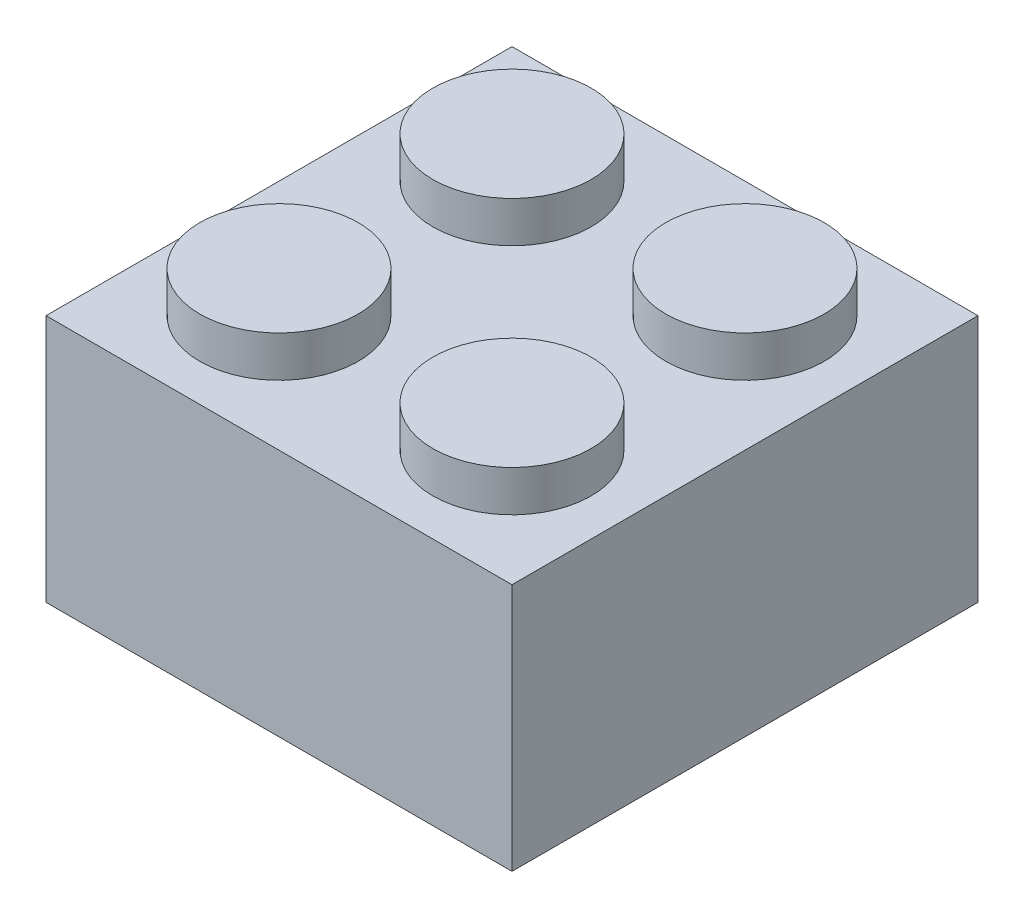
ISO-10303-21;
HEADER;
FILE_DESCRIPTION(('STEP AP214'),'2;1');
FILE_NAME('part.step','',(''),(''),'','','');
FILE_SCHEMA(('AUTOMOTIVE_DESIGN { 1 0 10303 214 1 1 1 1 }'));
ENDSEC;
DATA;
#1=APPLICATION_CONTEXT('core data for automotive mechanical design processes');
#2=APPLICATION_PROTOCOL_DEFINITION('international standard','automotive_design',2000,#1);
#3=PRODUCT_CONTEXT('',#1,'mechanical');
#4=PRODUCT('Part','Part','',(#3));
#5=PRODUCT_RELATED_PRODUCT_CATEGORY('part','',(#4));
#6=PRODUCT_DEFINITION_FORMATION('','',#4);
#7=PRODUCT_DEFINITION_CONTEXT('part definition',#1,'design');
#8=PRODUCT_DEFINITION('design','',#6,#7);
#9=PRODUCT_DEFINITION_SHAPE('','',#8);
#10=(LENGTH_UNIT() NAMED_UNIT(*) SI_UNIT(.MILLI.,.METRE.));
#11=(NAMED_UNIT(*) PLANE_ANGLE_UNIT() SI_UNIT($,.RADIAN.));
#12=(NAMED_UNIT(*) SI_UNIT($,.STERADIAN.) SOLID_ANGLE_UNIT());
#13=UNCERTAINTY_MEASURE_WITH_UNIT(LENGTH_MEASURE(1.E-05),#10,'distance_accuracy_value','');
#14=(GEOMETRIC_REPRESENTATION_CONTEXT(3) GLOBAL_UNCERTAINTY_ASSIGNED_CONTEXT((#13)) GLOBAL_UNIT_ASSIGNED_CONTEXT((#10,
#11,#12)) REPRESENTATION_CONTEXT('',''));
#15=CARTESIAN_POINT('',(0.,0.,0.));
#16=DIRECTION('',(0.,0.,1.));
#17=DIRECTION('',(1.,0.,0.));
#18=AXIS2_PLACEMENT_3D('',#15,#16,#17);
#19=CARTESIAN_POINT('',(7.93750000000001,4.2291,7.93749999999999));
#20=DIRECTION('',(0.,1.,0.));
#21=DIRECTION('',(0.,0.,1.));
#22=AXIS2_PLACEMENT_3D('',#19,#20,#21);
#23=PLANE('',#22);
#24=CARTESIAN_POINT('',(-3.96875,4.2291,3.96875));
#25=DIRECTION('',(0.,1.,0.));
#26=DIRECTION('',(0.,0.,1.));
#27=AXIS2_PLACEMENT_3D('',#24,#25,#26);
#28=CIRCLE('',#27,2.69875);
#29=CARTESIAN_POINT('',(-3.96875,4.2291,6.6675));
#30=VERTEX_POINT('',#29);
#31=EDGE_CURVE('E284',#30,#30,#28,.T.);
#32=ORIENTED_EDGE('',*,*,#31,.F.);
#33=EDGE_LOOP('',(#32));
#34=FACE_BOUND('',#33,.T.);
#35=CARTESIAN_POINT('',(3.96875,4.2291,3.96875));
#36=DIRECTION('',(0.,1.,0.));
#37=DIRECTION('',(0.,0.,1.));
#38=AXIS2_PLACEMENT_3D('',#35,#36,#37);
#39=CIRCLE('',#38,2.69875);
#40=CARTESIAN_POINT('',(3.96875,4.2291,6.6675));
#41=VERTEX_POINT('',#40);
#42=EDGE_CURVE('E299',#41,#41,#39,.T.);
#43=ORIENTED_EDGE('',*,*,#42,.F.);
#44=EDGE_LOOP('',(#43));
#45=FACE_BOUND('',#44,.T.);
#46=DIRECTION('',(0.,0.,-1.));
#47=VECTOR('',#46,1.);
#48=CARTESIAN_POINT('',(7.9375,4.2291,-7.9375));
#49=LINE('',#48,#47);
#50=CARTESIAN_POINT('',(7.93750000000001,4.2291,7.93749999999999));
#51=VERTEX_POINT('',#50);
#52=CARTESIAN_POINT('',(7.9375,4.2291,-7.9375));
#53=VERTEX_POINT('',#52);
#54=EDGE_CURVE('E173',#51,#53,#49,.T.);
#55=ORIENTED_EDGE('',*,*,#54,.T.);
#56=DIRECTION('',(-1.,0.,0.));
#57=VECTOR('',#56,1.);
#58=CARTESIAN_POINT('',(-7.9375,4.2291,-7.9375));
#59=LINE('',#58,#57);
#60=CARTESIAN_POINT('',(-7.9375,4.2291,-7.9375));
#61=VERTEX_POINT('',#60);
#62=EDGE_CURVE('E118',#53,#61,#59,.T.);
#63=ORIENTED_EDGE('',*,*,#62,.T.);
#64=DIRECTION('',(0.,0.,1.));
#65=VECTOR('',#64,1.);
#66=CARTESIAN_POINT('',(-7.9375,4.2291,-7.9375));
#67=LINE('',#66,#65);
#68=CARTESIAN_POINT('',(-7.93749999999999,4.2291,7.9375));
#69=VERTEX_POINT('',#68);
#70=EDGE_CURVE('E176',#61,#69,#67,.T.);
#71=ORIENTED_EDGE('',*,*,#70,.T.);
#72=DIRECTION('',(1.,0.,0.));
#73=VECTOR('',#72,1.);
#74=CARTESIAN_POINT('',(-7.93749999999999,4.2291,7.9375));
#75=LINE('',#74,#73);
#76=EDGE_CURVE('E90',#69,#51,#75,.T.);
#77=ORIENTED_EDGE('',*,*,#76,.T.);
#78=EDGE_LOOP('',(#55,#63,#71,#77));
#79=FACE_BOUND('',#78,.T.);
#80=CARTESIAN_POINT('',(3.96875,4.2291,-3.96875));
#81=DIRECTION('',(0.,1.,0.));
#82=DIRECTION('',(0.,0.,1.));
#83=AXIS2_PLACEMENT_3D('',#80,#81,#82);
#84=CIRCLE('',#83,2.69875);
#85=CARTESIAN_POINT('',(3.96875,4.2291,-1.27000000000001));
#86=VERTEX_POINT('',#85);
#87=EDGE_CURVE('E294',#86,#86,#84,.T.);
#88=ORIENTED_EDGE('',*,*,#87,.F.);
#89=EDGE_LOOP('',(#88));
#90=FACE_BOUND('',#89,.T.);
#91=CARTESIAN_POINT('',(-3.96875,4.2291,-3.96875));
#92=DIRECTION('',(0.,1.,0.));
#93=DIRECTION('',(0.,0.,1.));
#94=AXIS2_PLACEMENT_3D('',#91,#92,#93);
#95=CIRCLE('',#94,2.69875);
#96=CARTESIAN_POINT('',(-3.96875,4.2291,-1.27000000000001));
#97=VERTEX_POINT('',#96);
#98=EDGE_CURVE('E285',#97,#97,#95,.T.);
#99=ORIENTED_EDGE('',*,*,#98,.F.);
#100=EDGE_LOOP('',(#99));
#101=FACE_BOUND('',#100,.T.);
#102=ADVANCED_FACE('F66',(#34,#45,#79,#90,#101),#23,.T.);
#103=CARTESIAN_POINT('',(7.9375,4.2291,-7.9375));
#104=DIRECTION('',(-1.,0.,0.));
#105=DIRECTION('',(0.,0.,1.));
#106=AXIS2_PLACEMENT_3D('',#103,#104,#105);
#107=PLANE('',#106);
#108=DIRECTION('',(0.,0.,-1.));
#109=VECTOR('',#108,1.);
#110=CARTESIAN_POINT('',(7.9375,-4.2291,-7.9375));
#111=LINE('',#110,#109);
#112=CARTESIAN_POINT('',(7.93750000000001,-4.2291,7.93749999999999));
#113=VERTEX_POINT('',#112);
#114=CARTESIAN_POINT('',(7.9375,-4.2291,-7.9375));
#115=VERTEX_POINT('',#114);
#116=EDGE_CURVE('E180',#113,#115,#111,.T.);
#117=ORIENTED_EDGE('',*,*,#116,.T.);
#118=DIRECTION('',(0.,-1.,0.));
#119=VECTOR('',#118,1.);
#120=CARTESIAN_POINT('',(7.9375,4.2291,-7.9375));
#121=LINE('',#120,#119);
#122=EDGE_CURVE('E15',#53,#115,#121,.T.);
#123=ORIENTED_EDGE('',*,*,#122,.F.);
#124=ORIENTED_EDGE('',*,*,#54,.F.);
#125=DIRECTION('',(0.,-1.,0.));
#126=VECTOR('',#125,1.);
#127=CARTESIAN_POINT('',(7.93750000000001,4.2291,7.93749999999999));
#128=LINE('',#127,#126);
#129=EDGE_CURVE('E179',#51,#113,#128,.T.);
#130=ORIENTED_EDGE('',*,*,#129,.T.);
#131=EDGE_LOOP('',(#117,#123,#124,#130));
#132=FACE_BOUND('',#131,.T.);
#133=ADVANCED_FACE('F68',(#132),#107,.F.);
#134=CARTESIAN_POINT('',(-7.9375,4.2291,-7.9375));
#135=DIRECTION('',(0.,0.,1.));
#136=DIRECTION('',(1.,0.,0.));
#137=AXIS2_PLACEMENT_3D('',#134,#135,#136);
#138=PLANE('',#137);
#139=DIRECTION('',(-1.,0.,0.));
#140=VECTOR('',#139,1.);
#141=CARTESIAN_POINT('',(-7.9375,-4.2291,-7.9375));
#142=LINE('',#141,#140);
#143=CARTESIAN_POINT('',(-7.9375,-4.2291,-7.9375));
#144=VERTEX_POINT('',#143);
#145=EDGE_CURVE('E183',#115,#144,#142,.T.);
#146=ORIENTED_EDGE('',*,*,#145,.T.);
#147=DIRECTION('',(0.,-1.,0.));
#148=VECTOR('',#147,1.);
#149=CARTESIAN_POINT('',(-7.9375,4.2291,-7.9375));
#150=LINE('',#149,#148);
#151=EDGE_CURVE('E74',#61,#144,#150,.T.);
#152=ORIENTED_EDGE('',*,*,#151,.F.);
#153=ORIENTED_EDGE('',*,*,#62,.F.);
#154=ORIENTED_EDGE('',*,*,#122,.T.);
#155=EDGE_LOOP('',(#146,#152,#153,#154));
#156=FACE_BOUND('',#155,.T.);
#157=ADVANCED_FACE('F213',(#156),#138,.F.);
#158=CARTESIAN_POINT('',(-7.9375,4.2291,-7.9375));
#159=DIRECTION('',(1.,0.,0.));
#160=DIRECTION('',(0.,0.,-1.));
#161=AXIS2_PLACEMENT_3D('',#158,#159,#160);
#162=PLANE('',#161);
#163=DIRECTION('',(0.,0.,1.));
#164=VECTOR('',#163,1.);
#165=CARTESIAN_POINT('',(-7.9375,-4.2291,-7.9375));
#166=LINE('',#165,#164);
#167=CARTESIAN_POINT('',(-7.93749999999999,-4.2291,7.9375));
#168=VERTEX_POINT('',#167);
#169=EDGE_CURVE('E185',#144,#168,#166,.T.);
#170=ORIENTED_EDGE('',*,*,#169,.T.);
#171=DIRECTION('',(0.,-1.,0.));
#172=VECTOR('',#171,1.);
#173=CARTESIAN_POINT('',(-7.93749999999999,4.2291,7.9375));
#174=LINE('',#173,#172);
#175=EDGE_CURVE('E189',#69,#168,#174,.T.);
#176=ORIENTED_EDGE('',*,*,#175,.F.);
#177=ORIENTED_EDGE('',*,*,#70,.F.);
#178=ORIENTED_EDGE('',*,*,#151,.T.);
#179=EDGE_LOOP('',(#170,#176,#177,#178));
#180=FACE_BOUND('',#179,.T.);
#181=ADVANCED_FACE('F194',(#180),#162,.F.);
#182=CARTESIAN_POINT('',(-7.93749999999999,4.2291,7.9375));
#183=DIRECTION('',(0.,0.,-1.));
#184=DIRECTION('',(-1.,0.,0.));
#185=AXIS2_PLACEMENT_3D('',#182,#183,#184);
#186=PLANE('',#185);
#187=DIRECTION('',(1.,0.,0.));
#188=VECTOR('',#187,1.);
#189=CARTESIAN_POINT('',(-7.93749999999999,-4.2291,7.9375));
#190=LINE('',#189,#188);
#191=EDGE_CURVE('E111',#168,#113,#190,.T.);
#192=ORIENTED_EDGE('',*,*,#191,.T.);
#193=ORIENTED_EDGE('',*,*,#129,.F.);
#194=ORIENTED_EDGE('',*,*,#76,.F.);
#195=ORIENTED_EDGE('',*,*,#175,.T.);
#196=EDGE_LOOP('',(#192,#193,#194,#195));
#197=FACE_BOUND('',#196,.T.);
#198=ADVANCED_FACE('F202',(#197),#186,.F.);
#199=CARTESIAN_POINT('',(7.93750000000001,-4.2291,7.93749999999999));
#200=DIRECTION('',(0.,1.,0.));
#201=DIRECTION('',(0.,0.,1.));
#202=AXIS2_PLACEMENT_3D('',#199,#200,#201);
#203=PLANE('',#202);
#204=DIRECTION('',(0.,0.,1.));
#205=VECTOR('',#204,1.);
#206=CARTESIAN_POINT('',(6.6675,-4.2291,-17.6039213562373));
#207=LINE('',#206,#205);
#208=CARTESIAN_POINT('',(6.6675,-4.2291,-6.6675));
#209=VERTEX_POINT('',#208);
#210=CARTESIAN_POINT('',(6.66750000000001,-4.2291,6.66749999999999));
#211=VERTEX_POINT('',#210);
#212=EDGE_CURVE('E169',#209,#211,#207,.T.);
#213=ORIENTED_EDGE('',*,*,#212,.F.);
#214=DIRECTION('',(1.,0.,0.));
#215=VECTOR('',#214,1.);
#216=CARTESIAN_POINT('',(0.,-4.2291,-6.6675));
#217=LINE('',#216,#215);
#218=CARTESIAN_POINT('',(-6.6675,-4.2291,-6.6675));
#219=VERTEX_POINT('',#218);
#220=EDGE_CURVE('E324',#219,#209,#217,.T.);
#221=ORIENTED_EDGE('',*,*,#220,.F.);
#222=DIRECTION('',(0.,0.,-1.));
#223=VECTOR('',#222,1.);
#224=CARTESIAN_POINT('',(-6.6675,-4.2291,-17.6039213562373));
#225=LINE('',#224,#223);
#226=CARTESIAN_POINT('',(-6.66749999999999,-4.2291,6.6675));
#227=VERTEX_POINT('',#226);
#228=EDGE_CURVE('E164',#227,#219,#225,.T.);
#229=ORIENTED_EDGE('',*,*,#228,.F.);
#230=DIRECTION('',(-1.,0.,0.));
#231=VECTOR('',#230,1.);
#232=CARTESIAN_POINT('',(0.,-4.2291,6.6675));
#233=LINE('',#232,#231);
#234=EDGE_CURVE('E81',#211,#227,#233,.T.);
#235=ORIENTED_EDGE('',*,*,#234,.F.);
#236=EDGE_LOOP('',(#213,#221,#229,#235));
#237=FACE_BOUND('',#236,.T.);
#238=ORIENTED_EDGE('',*,*,#116,.F.);
#239=ORIENTED_EDGE('',*,*,#191,.F.);
#240=ORIENTED_EDGE('',*,*,#169,.F.);
#241=ORIENTED_EDGE('',*,*,#145,.F.);
#242=EDGE_LOOP('',(#238,#239,#240,#241));
#243=FACE_BOUND('',#242,.T.);
#244=ADVANCED_FACE('F198',(#237,#243),#203,.F.);
#245=CARTESIAN_POINT('',(0.,23.0876378542452,0.));
#246=DIRECTION('',(0.,-1.,0.));
#247=DIRECTION('',(0.,0.,-1.));
#248=AXIS2_PLACEMENT_3D('',#245,#246,#247);
#249=CYLINDRICAL_SURFACE('',#248,3.175);
#250=CARTESIAN_POINT('',(0.,-4.2291,0.));
#251=DIRECTION('',(0.,-1.,0.));
#252=DIRECTION('',(0.,0.,-1.));
#253=AXIS2_PLACEMENT_3D('',#250,#251,#252);
#254=CIRCLE('',#253,3.175);
#255=CARTESIAN_POINT('',(0.,-4.2291,-3.175));
#256=VERTEX_POINT('',#255);
#257=EDGE_CURVE('E160',#256,#256,#254,.T.);
#258=ORIENTED_EDGE('',*,*,#257,.F.);
#259=EDGE_LOOP('',(#258));
#260=FACE_BOUND('',#259,.T.);
#261=CARTESIAN_POINT('',(0.,2.9591,0.));
#262=DIRECTION('',(0.,1.,0.));
#263=DIRECTION('',(0.,0.,1.));
#264=AXIS2_PLACEMENT_3D('',#261,#262,#263);
#265=CIRCLE('',#264,3.175);
#266=CARTESIAN_POINT('',(0.,2.9591,3.175));
#267=VERTEX_POINT('',#266);
#268=EDGE_CURVE('E151',#267,#267,#265,.F.);
#269=ORIENTED_EDGE('',*,*,#268,.T.);
#270=EDGE_LOOP('',(#269));
#271=FACE_BOUND('',#270,.T.);
#272=ADVANCED_FACE('F209',(#260,#271),#249,.T.);
#273=CARTESIAN_POINT('',(0.,23.0876378542452,-6.6675));
#274=DIRECTION('',(0.,0.,-1.));
#275=DIRECTION('',(-1.,0.,0.));
#276=AXIS2_PLACEMENT_3D('',#273,#274,#275);
#277=PLANE('',#276);
#278=DIRECTION('',(0.,-1.,0.));
#279=VECTOR('',#278,1.);
#280=CARTESIAN_POINT('',(-6.6675,23.0876378542452,-6.6675));
#281=LINE('',#280,#279);
#282=CARTESIAN_POINT('',(-6.6675,2.9591,-6.6675));
#283=VERTEX_POINT('',#282);
#284=EDGE_CURVE('E146',#283,#219,#281,.T.);
#285=ORIENTED_EDGE('',*,*,#284,.T.);
#286=ORIENTED_EDGE('',*,*,#220,.T.);
#287=DIRECTION('',(0.,-1.,0.));
#288=VECTOR('',#287,1.);
#289=CARTESIAN_POINT('',(6.6675,23.0876378542452,-6.6675));
#290=LINE('',#289,#288);
#291=CARTESIAN_POINT('',(6.6675,2.9591,-6.6675));
#292=VERTEX_POINT('',#291);
#293=EDGE_CURVE('E148',#292,#209,#290,.T.);
#294=ORIENTED_EDGE('',*,*,#293,.F.);
#295=DIRECTION('',(1.,0.,0.));
#296=VECTOR('',#295,1.);
#297=CARTESIAN_POINT('',(0.,2.9591,-6.6675));
#298=LINE('',#297,#296);
#299=EDGE_CURVE('E141',#283,#292,#298,.T.);
#300=ORIENTED_EDGE('',*,*,#299,.F.);
#301=EDGE_LOOP('',(#285,#286,#294,#300));
#302=FACE_BOUND('',#301,.T.);
#303=ADVANCED_FACE('F143',(#302),#277,.F.);
#304=CARTESIAN_POINT('',(6.6675,23.0876378542452,-17.6039213562373));
#305=DIRECTION('',(1.,0.,0.));
#306=DIRECTION('',(0.,0.,-1.));
#307=AXIS2_PLACEMENT_3D('',#304,#305,#306);
#308=PLANE('',#307);
#309=ORIENTED_EDGE('',*,*,#293,.T.);
#310=ORIENTED_EDGE('',*,*,#212,.T.);
#311=DIRECTION('',(0.,-1.,0.));
#312=VECTOR('',#311,1.);
#313=CARTESIAN_POINT('',(6.66750000000001,23.0876378542452,6.66749999999999));
#314=LINE('',#313,#312);
#315=CARTESIAN_POINT('',(6.66750000000001,2.9591,6.66749999999999));
#316=VERTEX_POINT('',#315);
#317=EDGE_CURVE('E167',#316,#211,#314,.T.);
#318=ORIENTED_EDGE('',*,*,#317,.F.);
#319=DIRECTION('',(0.,0.,1.));
#320=VECTOR('',#319,1.);
#321=CARTESIAN_POINT('',(6.6675,2.9591,-17.6039213562373));
#322=LINE('',#321,#320);
#323=EDGE_CURVE('E316',#292,#316,#322,.T.);
#324=ORIENTED_EDGE('',*,*,#323,.F.);
#325=EDGE_LOOP('',(#309,#310,#318,#324));
#326=FACE_BOUND('',#325,.T.);
#327=ADVANCED_FACE('F232',(#326),#308,.F.);
#328=CARTESIAN_POINT('',(0.,23.0876378542452,6.6675));
#329=DIRECTION('',(0.,0.,1.));
#330=DIRECTION('',(1.,0.,0.));
#331=AXIS2_PLACEMENT_3D('',#328,#329,#330);
#332=PLANE('',#331);
#333=ORIENTED_EDGE('',*,*,#317,.T.);
#334=ORIENTED_EDGE('',*,*,#234,.T.);
#335=DIRECTION('',(0.,-1.,0.));
#336=VECTOR('',#335,1.);
#337=CARTESIAN_POINT('',(-6.66749999999999,23.0876378542452,6.6675));
#338=LINE('',#337,#336);
#339=CARTESIAN_POINT('',(-6.66749999999999,2.9591,6.6675));
#340=VERTEX_POINT('',#339);
#341=EDGE_CURVE('E152',#340,#227,#338,.T.);
#342=ORIENTED_EDGE('',*,*,#341,.F.);
#343=DIRECTION('',(-1.,0.,0.));
#344=VECTOR('',#343,1.);
#345=CARTESIAN_POINT('',(0.,2.9591,6.6675));
#346=LINE('',#345,#344);
#347=EDGE_CURVE('E158',#316,#340,#346,.T.);
#348=ORIENTED_EDGE('',*,*,#347,.F.);
#349=EDGE_LOOP('',(#333,#334,#342,#348));
#350=FACE_BOUND('',#349,.T.);
#351=ADVANCED_FACE('F229',(#350),#332,.F.);
#352=CARTESIAN_POINT('',(-6.6675,23.0876378542452,-17.6039213562373));
#353=DIRECTION('',(-1.,0.,0.));
#354=DIRECTION('',(0.,0.,1.));
#355=AXIS2_PLACEMENT_3D('',#352,#353,#354);
#356=PLANE('',#355);
#357=ORIENTED_EDGE('',*,*,#341,.T.);
#358=ORIENTED_EDGE('',*,*,#228,.T.);
#359=ORIENTED_EDGE('',*,*,#284,.F.);
#360=DIRECTION('',(0.,0.,-1.));
#361=VECTOR('',#360,1.);
#362=CARTESIAN_POINT('',(-6.6675,2.9591,-17.6039213562373));
#363=LINE('',#362,#361);
#364=EDGE_CURVE('E155',#340,#283,#363,.T.);
#365=ORIENTED_EDGE('',*,*,#364,.F.);
#366=EDGE_LOOP('',(#357,#358,#359,#365));
#367=FACE_BOUND('',#366,.T.);
#368=ADVANCED_FACE('F162',(#367),#356,.F.);
#369=CARTESIAN_POINT('',(7.93750000000001,2.9591,7.93749999999999));
#370=DIRECTION('',(0.,1.,0.));
#371=DIRECTION('',(0.,0.,1.));
#372=AXIS2_PLACEMENT_3D('',#369,#370,#371);
#373=PLANE('',#372);
#374=ORIENTED_EDGE('',*,*,#364,.T.);
#375=ORIENTED_EDGE('',*,*,#299,.T.);
#376=ORIENTED_EDGE('',*,*,#323,.T.);
#377=ORIENTED_EDGE('',*,*,#347,.T.);
#378=EDGE_LOOP('',(#374,#375,#376,#377));
#379=FACE_BOUND('',#378,.T.);
#380=ORIENTED_EDGE('',*,*,#268,.F.);
#381=EDGE_LOOP('',(#380));
#382=FACE_BOUND('',#381,.T.);
#383=ADVANCED_FACE('F156',(#379,#382),#373,.F.);
#384=CARTESIAN_POINT('',(0.,-4.2291,0.));
#385=DIRECTION('',(0.,-1.,0.));
#386=DIRECTION('',(0.,0.,-1.));
#387=AXIS2_PLACEMENT_3D('',#384,#385,#386);
#388=CIRCLE('',#387,2.413);
#389=CARTESIAN_POINT('',(0.,-4.2291,-2.413));
#390=VERTEX_POINT('',#389);
#391=EDGE_CURVE('E306',#390,#390,#388,.T.);
#392=ORIENTED_EDGE('',*,*,#391,.F.);
#393=EDGE_LOOP('',(#392));
#394=FACE_BOUND('',#393,.T.);
#395=ORIENTED_EDGE('',*,*,#257,.T.);
#396=EDGE_LOOP('',(#395));
#397=FACE_BOUND('',#396,.T.);
#398=ADVANCED_FACE('F212',(#394,#397),#203,.F.);
#399=CARTESIAN_POINT('',(7.93750000000001,2.9591,7.93749999999999));
#400=DIRECTION('',(0.,1.,0.));
#401=DIRECTION('',(0.,0.,1.));
#402=AXIS2_PLACEMENT_3D('',#399,#400,#401);
#403=PLANE('',#402);
#404=CARTESIAN_POINT('',(0.,2.9591,0.));
#405=DIRECTION('',(0.,1.,0.));
#406=DIRECTION('',(0.,0.,1.));
#407=AXIS2_PLACEMENT_3D('',#404,#405,#406);
#408=CIRCLE('',#407,2.413);
#409=CARTESIAN_POINT('',(0.,2.9591,2.413));
#410=VERTEX_POINT('',#409);
#411=EDGE_CURVE('E312',#410,#410,#408,.F.);
#412=ORIENTED_EDGE('',*,*,#411,.T.);
#413=EDGE_LOOP('',(#412));
#414=FACE_BOUND('',#413,.T.);
#415=ADVANCED_FACE('F240',(#414),#403,.F.);
#416=CARTESIAN_POINT('',(0.,23.0876378542452,0.));
#417=DIRECTION('',(0.,-1.,0.));
#418=DIRECTION('',(0.,0.,-1.));
#419=AXIS2_PLACEMENT_3D('',#416,#417,#418);
#420=CYLINDRICAL_SURFACE('',#419,2.413);
#421=ORIENTED_EDGE('',*,*,#391,.T.);
#422=EDGE_LOOP('',(#421));
#423=FACE_BOUND('',#422,.T.);
#424=ORIENTED_EDGE('',*,*,#411,.F.);
#425=EDGE_LOOP('',(#424));
#426=FACE_BOUND('',#425,.T.);
#427=ADVANCED_FACE('F243',(#423,#426),#420,.F.);
#428=CARTESIAN_POINT('',(3.96875,5.6261,3.96875));
#429=DIRECTION('',(0.,-1.,0.));
#430=DIRECTION('',(0.,0.,-1.));
#431=AXIS2_PLACEMENT_3D('',#428,#429,#430);
#432=CYLINDRICAL_SURFACE('',#431,2.69875);
#433=CARTESIAN_POINT('',(3.96875,5.6261,3.96875));
#434=DIRECTION('',(0.,1.,0.));
#435=DIRECTION('',(0.,0.,1.));
#436=AXIS2_PLACEMENT_3D('',#433,#434,#435);
#437=CIRCLE('',#436,2.69875);
#438=CARTESIAN_POINT('',(3.96875,5.6261,6.6675));
#439=VERTEX_POINT('',#438);
#440=EDGE_CURVE('E302',#439,#439,#437,.T.);
#441=ORIENTED_EDGE('',*,*,#440,.F.);
#442=EDGE_LOOP('',(#441));
#443=FACE_BOUND('',#442,.T.);
#444=ORIENTED_EDGE('',*,*,#42,.T.);
#445=EDGE_LOOP('',(#444));
#446=FACE_BOUND('',#445,.T.);
#447=ADVANCED_FACE('F247',(#443,#446),#432,.T.);
#448=CARTESIAN_POINT('',(3.96875,5.6261,3.96875));
#449=DIRECTION('',(0.,1.,0.));
#450=DIRECTION('',(0.,0.,1.));
#451=AXIS2_PLACEMENT_3D('',#448,#449,#450);
#452=PLANE('',#451);
#453=ORIENTED_EDGE('',*,*,#440,.T.);
#454=EDGE_LOOP('',(#453));
#455=FACE_BOUND('',#454,.T.);
#456=ADVANCED_FACE('F251',(#455),#452,.T.);
#457=CARTESIAN_POINT('',(3.96875,5.6261,-3.96875));
#458=DIRECTION('',(0.,-1.,0.));
#459=DIRECTION('',(0.,0.,-1.));
#460=AXIS2_PLACEMENT_3D('',#457,#458,#459);
#461=CYLINDRICAL_SURFACE('',#460,2.69875);
#462=CARTESIAN_POINT('',(3.96875,5.6261,-3.96875));
#463=DIRECTION('',(0.,1.,0.));
#464=DIRECTION('',(0.,0.,1.));
#465=AXIS2_PLACEMENT_3D('',#462,#463,#464);
#466=CIRCLE('',#465,2.69875);
#467=CARTESIAN_POINT('',(3.96875,5.6261,-1.27000000000001));
#468=VERTEX_POINT('',#467);
#469=EDGE_CURVE('E296',#468,#468,#466,.T.);
#470=ORIENTED_EDGE('',*,*,#469,.F.);
#471=EDGE_LOOP('',(#470));
#472=FACE_BOUND('',#471,.T.);
#473=ORIENTED_EDGE('',*,*,#87,.T.);
#474=EDGE_LOOP('',(#473));
#475=FACE_BOUND('',#474,.T.);
#476=ADVANCED_FACE('F255',(#472,#475),#461,.T.);
#477=CARTESIAN_POINT('',(3.96875,5.6261,-3.96875));
#478=DIRECTION('',(0.,1.,0.));
#479=DIRECTION('',(0.,0.,1.));
#480=AXIS2_PLACEMENT_3D('',#477,#478,#479);
#481=PLANE('',#480);
#482=ORIENTED_EDGE('',*,*,#469,.T.);
#483=EDGE_LOOP('',(#482));
#484=FACE_BOUND('',#483,.T.);
#485=ADVANCED_FACE('F259',(#484),#481,.T.);
#486=CARTESIAN_POINT('',(-3.96875,5.6261,3.96875));
#487=DIRECTION('',(0.,-1.,0.));
#488=DIRECTION('',(0.,0.,-1.));
#489=AXIS2_PLACEMENT_3D('',#486,#487,#488);
#490=CYLINDRICAL_SURFACE('',#489,2.69875);
#491=CARTESIAN_POINT('',(-3.96875,5.6261,3.96875));
#492=DIRECTION('',(0.,1.,0.));
#493=DIRECTION('',(0.,0.,1.));
#494=AXIS2_PLACEMENT_3D('',#491,#492,#493);
#495=CIRCLE('',#494,2.69875);
#496=CARTESIAN_POINT('',(-3.96875,5.6261,6.6675));
#497=VERTEX_POINT('',#496);
#498=EDGE_CURVE('E288',#497,#497,#495,.T.);
#499=ORIENTED_EDGE('',*,*,#498,.F.);
#500=EDGE_LOOP('',(#499));
#501=FACE_BOUND('',#500,.T.);
#502=ORIENTED_EDGE('',*,*,#31,.T.);
#503=EDGE_LOOP('',(#502));
#504=FACE_BOUND('',#503,.T.);
#505=ADVANCED_FACE('F263',(#501,#504),#490,.T.);
#506=CARTESIAN_POINT('',(-3.96875,5.6261,3.96875));
#507=DIRECTION('',(0.,1.,0.));
#508=DIRECTION('',(0.,0.,1.));
#509=AXIS2_PLACEMENT_3D('',#506,#507,#508);
#510=PLANE('',#509);
#511=ORIENTED_EDGE('',*,*,#498,.T.);
#512=EDGE_LOOP('',(#511));
#513=FACE_BOUND('',#512,.T.);
#514=ADVANCED_FACE('F267',(#513),#510,.T.);
#515=CARTESIAN_POINT('',(-3.96875,5.6261,-3.96875));
#516=DIRECTION('',(0.,-1.,0.));
#517=DIRECTION('',(0.,0.,-1.));
#518=AXIS2_PLACEMENT_3D('',#515,#516,#517);
#519=CYLINDRICAL_SURFACE('',#518,2.69875);
#520=CARTESIAN_POINT('',(-3.96875,5.6261,-3.96875));
#521=DIRECTION('',(0.,1.,0.));
#522=DIRECTION('',(0.,0.,1.));
#523=AXIS2_PLACEMENT_3D('',#520,#521,#522);
#524=CIRCLE('',#523,2.69875);
#525=CARTESIAN_POINT('',(-3.96875,5.6261,-1.27000000000001));
#526=VERTEX_POINT('',#525);
#527=EDGE_CURVE('E283',#526,#526,#524,.T.);
#528=ORIENTED_EDGE('',*,*,#527,.F.);
#529=EDGE_LOOP('',(#528));
#530=FACE_BOUND('',#529,.T.);
#531=ORIENTED_EDGE('',*,*,#98,.T.);
#532=EDGE_LOOP('',(#531));
#533=FACE_BOUND('',#532,.T.);
#534=ADVANCED_FACE('F271',(#530,#533),#519,.T.);
#535=CARTESIAN_POINT('',(-3.96875,5.6261,-3.96875));
#536=DIRECTION('',(0.,1.,0.));
#537=DIRECTION('',(0.,0.,1.));
#538=AXIS2_PLACEMENT_3D('',#535,#536,#537);
#539=PLANE('',#538);
#540=ORIENTED_EDGE('',*,*,#527,.T.);
#541=EDGE_LOOP('',(#540));
#542=FACE_BOUND('',#541,.T.);
#543=ADVANCED_FACE('F275',(#542),#539,.T.);
#544=CLOSED_SHELL('',(#102,#133,#157,#181,#198,#244,#272,#303,#327,#351,#368,#383,#398,#415,
#427,#447,#456,#476,#485,#505,#514,#534,#543));
#545=MANIFOLD_SOLID_BREP('B2',#544);
#546=ADVANCED_BREP_SHAPE_REPRESENTATION('',(#18,#545),#14);
#547=SHAPE_DEFINITION_REPRESENTATION(#9,#546);
ENDSEC;
END-ISO-10303-21;
